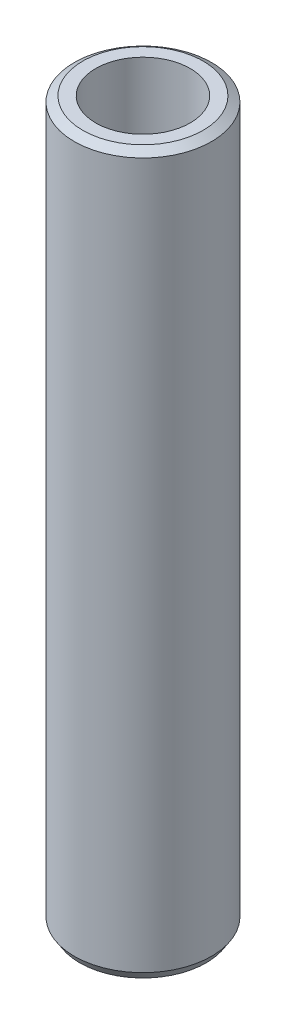
ISO-10303-21;
HEADER;
FILE_DESCRIPTION(('STEP AP214'),'2;1');
FILE_NAME('part.step','',(''),(''),'','','');
FILE_SCHEMA(('AUTOMOTIVE_DESIGN { 1 0 10303 214 1 1 1 1 }'));
ENDSEC;
DATA;
#1=APPLICATION_CONTEXT('core data for automotive mechanical design processes');
#2=APPLICATION_PROTOCOL_DEFINITION('international standard','automotive_design',2000,#1);
#3=PRODUCT_CONTEXT('',#1,'mechanical');
#4=PRODUCT('Part','Part','',(#3));
#5=PRODUCT_RELATED_PRODUCT_CATEGORY('part','',(#4));
#6=PRODUCT_DEFINITION_FORMATION('','',#4);
#7=PRODUCT_DEFINITION_CONTEXT('part definition',#1,'design');
#8=PRODUCT_DEFINITION('design','',#6,#7);
#9=PRODUCT_DEFINITION_SHAPE('','',#8);
#10=(LENGTH_UNIT() NAMED_UNIT(*) SI_UNIT(.MILLI.,.METRE.));
#11=(NAMED_UNIT(*) PLANE_ANGLE_UNIT() SI_UNIT($,.RADIAN.));
#12=(NAMED_UNIT(*) SI_UNIT($,.STERADIAN.) SOLID_ANGLE_UNIT());
#13=UNCERTAINTY_MEASURE_WITH_UNIT(LENGTH_MEASURE(1.E-05),#10,'distance_accuracy_value','');
#14=(GEOMETRIC_REPRESENTATION_CONTEXT(3) GLOBAL_UNCERTAINTY_ASSIGNED_CONTEXT((#13)) GLOBAL_UNIT_ASSIGNED_CONTEXT((#10,
#11,#12)) REPRESENTATION_CONTEXT('',''));
#15=CARTESIAN_POINT('',(0.,0.,0.));
#16=DIRECTION('',(0.,0.,1.));
#17=DIRECTION('',(1.,0.,0.));
#18=AXIS2_PLACEMENT_3D('',#15,#16,#17);
#19=CARTESIAN_POINT('',(0.,498.158303279908,0.));
#20=DIRECTION('',(0.,-1.,0.));
#21=DIRECTION('',(0.,0.,-1.));
#22=AXIS2_PLACEMENT_3D('',#19,#20,#21);
#23=CYLINDRICAL_SURFACE('',#22,47.5);
#24=CARTESIAN_POINT('',(0.,494.383840959229,0.));
#25=DIRECTION('',(0.,1.,0.));
#26=DIRECTION('',(0.,0.,1.));
#27=AXIS2_PLACEMENT_3D('',#24,#25,#26);
#28=CIRCLE('',#27,47.5);
#29=CARTESIAN_POINT('',(0.,494.383840959229,47.5));
#30=VERTEX_POINT('',#29);
#31=EDGE_CURVE('E50',#30,#30,#28,.F.);
#32=ORIENTED_EDGE('',*,*,#31,.T.);
#33=EDGE_LOOP('',(#32));
#34=FACE_BOUND('',#33,.T.);
#35=CARTESIAN_POINT('',(0.,5.87839562243886,0.));
#36=DIRECTION('',(0.,1.,0.));
#37=DIRECTION('',(0.,0.,1.));
#38=AXIS2_PLACEMENT_3D('',#35,#36,#37);
#39=CIRCLE('',#38,47.5);
#40=CARTESIAN_POINT('',(0.,5.87839562243886,47.5));
#41=VERTEX_POINT('',#40);
#42=EDGE_CURVE('E51',#41,#41,#39,.T.);
#43=ORIENTED_EDGE('',*,*,#42,.T.);
#44=EDGE_LOOP('',(#43));
#45=FACE_BOUND('',#44,.T.);
#46=ADVANCED_FACE('F39',(#34,#45),#23,.T.);
#47=CARTESIAN_POINT('',(0.,498.158303279908,0.));
#48=DIRECTION('',(0.,1.,0.));
#49=DIRECTION('',(0.,0.,1.));
#50=AXIS2_PLACEMENT_3D('',#47,#48,#49);
#51=PLANE('',#50);
#52=CARTESIAN_POINT('',(0.,498.158303279908,0.));
#53=DIRECTION('',(0.,1.,0.));
#54=DIRECTION('',(0.,0.,1.));
#55=AXIS2_PLACEMENT_3D('',#52,#53,#54);
#56=CIRCLE('',#55,41.6216043775612);
#57=CARTESIAN_POINT('',(0.,498.158303279908,41.6216043775612));
#58=VERTEX_POINT('',#57);
#59=EDGE_CURVE('E54',#58,#58,#56,.T.);
#60=ORIENTED_EDGE('',*,*,#59,.T.);
#61=EDGE_LOOP('',(#60));
#62=FACE_BOUND('',#61,.T.);
#63=CARTESIAN_POINT('',(0.,498.158303279908,0.));
#64=DIRECTION('',(0.,1.,0.));
#65=DIRECTION('',(0.,0.,1.));
#66=AXIS2_PLACEMENT_3D('',#63,#64,#65);
#67=CIRCLE('',#66,32.7021773130006);
#68=CARTESIAN_POINT('',(0.,498.158303279908,32.7021773130006));
#69=VERTEX_POINT('',#68);
#70=EDGE_CURVE('E58',#69,#69,#67,.T.);
#71=ORIENTED_EDGE('',*,*,#70,.F.);
#72=EDGE_LOOP('',(#71));
#73=FACE_BOUND('',#72,.T.);
#74=ADVANCED_FACE('F69',(#62,#73),#51,.T.);
#75=CARTESIAN_POINT('',(0.,0.,0.));
#76=DIRECTION('',(0.,1.,0.));
#77=DIRECTION('',(0.,0.,1.));
#78=AXIS2_PLACEMENT_3D('',#75,#76,#77);
#79=PLANE('',#78);
#80=CARTESIAN_POINT('',(0.,0.,0.));
#81=DIRECTION('',(0.,1.,0.));
#82=DIRECTION('',(0.,0.,1.));
#83=AXIS2_PLACEMENT_3D('',#80,#81,#82);
#84=CIRCLE('',#83,43.7255376793215);
#85=CARTESIAN_POINT('',(0.,0.,43.7255376793215));
#86=VERTEX_POINT('',#85);
#87=EDGE_CURVE('E10',#86,#86,#84,.F.);
#88=ORIENTED_EDGE('',*,*,#87,.T.);
#89=EDGE_LOOP('',(#88));
#90=FACE_BOUND('',#89,.T.);
#91=CARTESIAN_POINT('',(0.,0.,0.));
#92=DIRECTION('',(0.,1.,0.));
#93=DIRECTION('',(0.,0.,1.));
#94=AXIS2_PLACEMENT_3D('',#91,#92,#93);
#95=CIRCLE('',#94,32.7021773130006);
#96=CARTESIAN_POINT('',(0.,0.,32.7021773130006));
#97=VERTEX_POINT('',#96);
#98=EDGE_CURVE('E63',#97,#97,#95,.T.);
#99=ORIENTED_EDGE('',*,*,#98,.T.);
#100=EDGE_LOOP('',(#99));
#101=FACE_BOUND('',#100,.T.);
#102=ADVANCED_FACE('F75',(#90,#101),#79,.F.);
#103=CARTESIAN_POINT('',(0.,498.158303279908,0.));
#104=DIRECTION('',(0.,-1.,0.));
#105=DIRECTION('',(0.,0.,-1.));
#106=AXIS2_PLACEMENT_3D('',#103,#104,#105);
#107=CYLINDRICAL_SURFACE('',#106,32.7021773130006);
#108=ORIENTED_EDGE('',*,*,#70,.T.);
#109=EDGE_LOOP('',(#108));
#110=FACE_BOUND('',#109,.T.);
#111=ORIENTED_EDGE('',*,*,#98,.F.);
#112=EDGE_LOOP('',(#111));
#113=FACE_BOUND('',#112,.T.);
#114=ADVANCED_FACE('F70',(#110,#113),#107,.F.);
#115=CARTESIAN_POINT('',(0.,498.158303279908,0.));
#116=DIRECTION('',(0.,-1.,0.));
#117=DIRECTION('',(0.,0.,-1.));
#118=AXIS2_PLACEMENT_3D('',#115,#116,#117);
#119=CONICAL_SURFACE('',#118,41.6216043775612,1.00000145773345);
#120=ORIENTED_EDGE('',*,*,#31,.F.);
#121=EDGE_LOOP('',(#120));
#122=FACE_BOUND('',#121,.T.);
#123=ORIENTED_EDGE('',*,*,#59,.F.);
#124=EDGE_LOOP('',(#123));
#125=FACE_BOUND('',#124,.T.);
#126=ADVANCED_FACE('F81',(#122,#125),#119,.T.);
#127=CARTESIAN_POINT('',(0.,5.87839562243886,0.));
#128=DIRECTION('',(0.,1.,0.));
#129=DIRECTION('',(0.,0.,1.));
#130=AXIS2_PLACEMENT_3D('',#127,#128,#129);
#131=CONICAL_SURFACE('',#130,47.5,0.57079486906145);
#132=ORIENTED_EDGE('',*,*,#87,.F.);
#133=EDGE_LOOP('',(#132));
#134=FACE_BOUND('',#133,.T.);
#135=ORIENTED_EDGE('',*,*,#42,.F.);
#136=EDGE_LOOP('',(#135));
#137=FACE_BOUND('',#136,.T.);
#138=ADVANCED_FACE('F45',(#134,#137),#131,.T.);
#139=CLOSED_SHELL('',(#46,#74,#102,#114,#126,#138));
#140=MANIFOLD_SOLID_BREP('B2',#139);
#141=ADVANCED_BREP_SHAPE_REPRESENTATION('',(#18,#140),#14);
#142=SHAPE_DEFINITION_REPRESENTATION(#9,#141);
ENDSEC;
END-ISO-10303-21;
